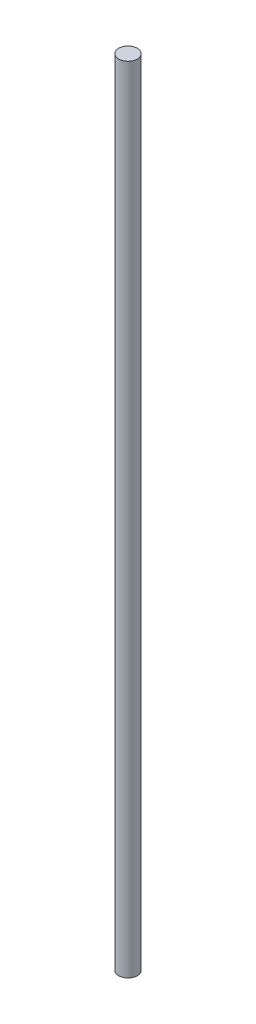
ISO-10303-21;
HEADER;
FILE_DESCRIPTION(('STEP AP214'),'2;1');
FILE_NAME('part.step','',(''),(''),'','','');
FILE_SCHEMA(('AUTOMOTIVE_DESIGN { 1 0 10303 214 1 1 1 1 }'));
ENDSEC;
DATA;
#1=APPLICATION_CONTEXT('core data for automotive mechanical design processes');
#2=APPLICATION_PROTOCOL_DEFINITION('international standard','automotive_design',2000,#1);
#3=PRODUCT_CONTEXT('',#1,'mechanical');
#4=PRODUCT('Part','Part','',(#3));
#5=PRODUCT_RELATED_PRODUCT_CATEGORY('part','',(#4));
#6=PRODUCT_DEFINITION_FORMATION('','',#4);
#7=PRODUCT_DEFINITION_CONTEXT('part definition',#1,'design');
#8=PRODUCT_DEFINITION('design','',#6,#7);
#9=PRODUCT_DEFINITION_SHAPE('','',#8);
#10=(LENGTH_UNIT() NAMED_UNIT(*) SI_UNIT(.MILLI.,.METRE.));
#11=(NAMED_UNIT(*) PLANE_ANGLE_UNIT() SI_UNIT($,.RADIAN.));
#12=(NAMED_UNIT(*) SI_UNIT($,.STERADIAN.) SOLID_ANGLE_UNIT());
#13=UNCERTAINTY_MEASURE_WITH_UNIT(LENGTH_MEASURE(1.E-05),#10,'distance_accuracy_value','');
#14=(GEOMETRIC_REPRESENTATION_CONTEXT(3) GLOBAL_UNCERTAINTY_ASSIGNED_CONTEXT((#13)) GLOBAL_UNIT_ASSIGNED_CONTEXT((#10,
#11,#12)) REPRESENTATION_CONTEXT('',''));
#15=CARTESIAN_POINT('',(0.,0.,0.));
#16=DIRECTION('',(0.,0.,1.));
#17=DIRECTION('',(1.,0.,0.));
#18=AXIS2_PLACEMENT_3D('',#15,#16,#17);
#19=CARTESIAN_POINT('',(0.,7000.,0.));
#20=DIRECTION('',(0.,-1.,0.));
#21=DIRECTION('',(0.,0.,-1.));
#22=AXIS2_PLACEMENT_3D('',#19,#20,#21);
#23=CYLINDRICAL_SURFACE('',#22,82.5);
#24=CARTESIAN_POINT('',(0.,7000.,0.));
#25=DIRECTION('',(0.,1.,0.));
#26=DIRECTION('',(0.,0.,1.));
#27=AXIS2_PLACEMENT_3D('',#24,#25,#26);
#28=CIRCLE('',#27,82.5);
#29=CARTESIAN_POINT('',(0.,7000.,82.5));
#30=VERTEX_POINT('',#29);
#31=EDGE_CURVE('E10',#30,#30,#28,.T.);
#32=ORIENTED_EDGE('',*,*,#31,.F.);
#33=EDGE_LOOP('',(#32));
#34=FACE_BOUND('',#33,.T.);
#35=CARTESIAN_POINT('',(0.,0.,0.));
#36=DIRECTION('',(0.,1.,0.));
#37=DIRECTION('',(0.,0.,1.));
#38=AXIS2_PLACEMENT_3D('',#35,#36,#37);
#39=CIRCLE('',#38,82.5);
#40=CARTESIAN_POINT('',(0.,0.,82.5));
#41=VERTEX_POINT('',#40);
#42=EDGE_CURVE('E34',#41,#41,#39,.T.);
#43=ORIENTED_EDGE('',*,*,#42,.T.);
#44=EDGE_LOOP('',(#43));
#45=FACE_BOUND('',#44,.T.);
#46=ADVANCED_FACE('F31',(#34,#45),#23,.T.);
#47=CARTESIAN_POINT('',(0.,7000.,0.));
#48=DIRECTION('',(0.,1.,0.));
#49=DIRECTION('',(0.,0.,1.));
#50=AXIS2_PLACEMENT_3D('',#47,#48,#49);
#51=PLANE('',#50);
#52=ORIENTED_EDGE('',*,*,#31,.T.);
#53=EDGE_LOOP('',(#52));
#54=FACE_BOUND('',#53,.T.);
#55=ADVANCED_FACE('F46',(#54),#51,.T.);
#56=CARTESIAN_POINT('',(0.,0.,0.));
#57=DIRECTION('',(0.,1.,0.));
#58=DIRECTION('',(0.,0.,1.));
#59=AXIS2_PLACEMENT_3D('',#56,#57,#58);
#60=PLANE('',#59);
#61=ORIENTED_EDGE('',*,*,#42,.F.);
#62=EDGE_LOOP('',(#61));
#63=FACE_BOUND('',#62,.T.);
#64=ADVANCED_FACE('F44',(#63),#60,.F.);
#65=CLOSED_SHELL('',(#46,#55,#64));
#66=MANIFOLD_SOLID_BREP('B2',#65);
#67=ADVANCED_BREP_SHAPE_REPRESENTATION('',(#18,#66),#14);
#68=SHAPE_DEFINITION_REPRESENTATION(#9,#67);
ENDSEC;
END-ISO-10303-21;
